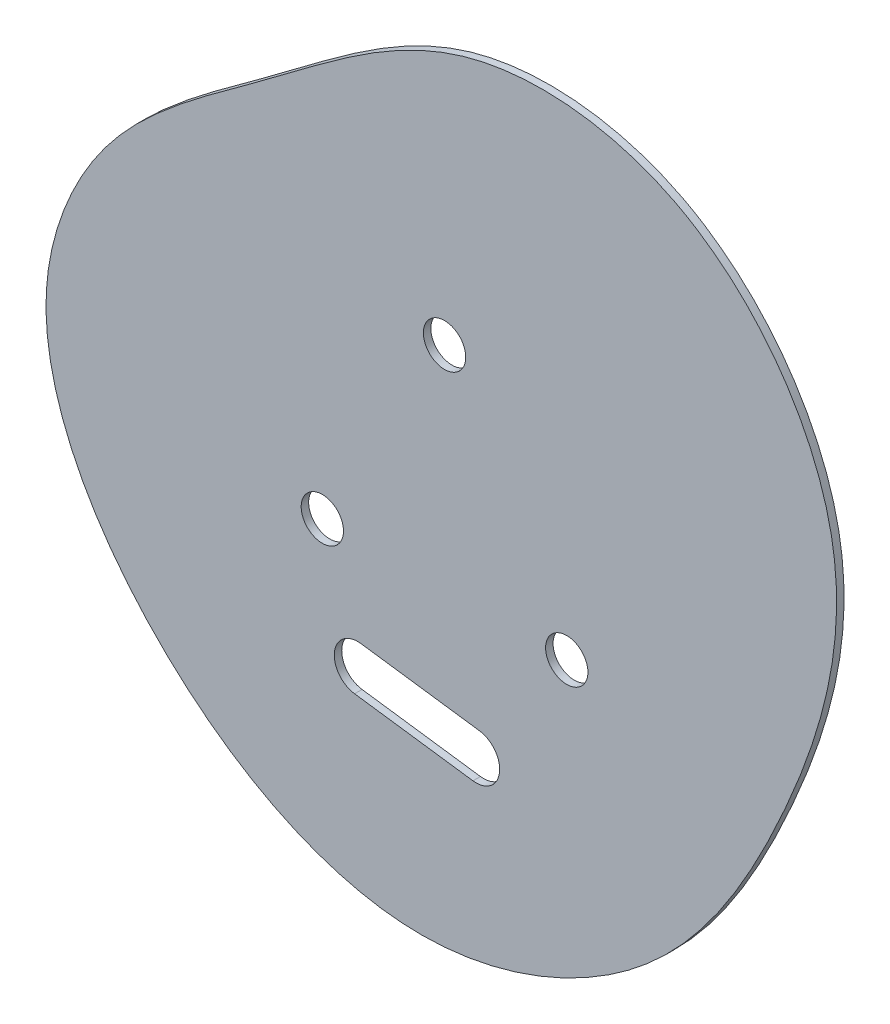
ISO-10303-21;
HEADER;
FILE_DESCRIPTION(('STEP AP214'),'2;1');
FILE_NAME('part.step','',(''),(''),'','','');
FILE_SCHEMA(('AUTOMOTIVE_DESIGN { 1 0 10303 214 1 1 1 1 }'));
ENDSEC;
DATA;
#1=APPLICATION_CONTEXT('core data for automotive mechanical design processes');
#2=APPLICATION_PROTOCOL_DEFINITION('international standard','automotive_design',2000,#1);
#3=PRODUCT_CONTEXT('',#1,'mechanical');
#4=PRODUCT('Part','Part','',(#3));
#5=PRODUCT_RELATED_PRODUCT_CATEGORY('part','',(#4));
#6=PRODUCT_DEFINITION_FORMATION('','',#4);
#7=PRODUCT_DEFINITION_CONTEXT('part definition',#1,'design');
#8=PRODUCT_DEFINITION('design','',#6,#7);
#9=PRODUCT_DEFINITION_SHAPE('','',#8);
#10=(LENGTH_UNIT() NAMED_UNIT(*) SI_UNIT(.MILLI.,.METRE.));
#11=(NAMED_UNIT(*) PLANE_ANGLE_UNIT() SI_UNIT($,.RADIAN.));
#12=(NAMED_UNIT(*) SI_UNIT($,.STERADIAN.) SOLID_ANGLE_UNIT());
#13=UNCERTAINTY_MEASURE_WITH_UNIT(LENGTH_MEASURE(1.E-05),#10,'distance_accuracy_value','');
#14=(GEOMETRIC_REPRESENTATION_CONTEXT(3) GLOBAL_UNCERTAINTY_ASSIGNED_CONTEXT((#13)) GLOBAL_UNIT_ASSIGNED_CONTEXT((#10,
#11,#12)) REPRESENTATION_CONTEXT('',''));
#15=CARTESIAN_POINT('',(0.,0.,0.));
#16=DIRECTION('',(0.,0.,1.));
#17=DIRECTION('',(1.,0.,0.));
#18=AXIS2_PLACEMENT_3D('',#15,#16,#17);
#19=CARTESIAN_POINT('',(-33.7591925316214,-51.0877572958972,-0.396875));
#20=DIRECTION('',(0.,0.,1.));
#21=DIRECTION('',(-1.,0.,0.));
#22=AXIS2_PLACEMENT_3D('',#19,#20,#21);
#23=PLANE('',#22);
#24=DIRECTION('',(0.990734013971996,-0.135816470131342,0.));
#25=VECTOR('',#24,1.);
#26=CARTESIAN_POINT('',(-22.1553572482574,-38.1563847863937,-0.396875));
#27=LINE('',#26,#25);
#28=CARTESIAN_POINT('',(-22.1553572482574,-38.1563847863937,-0.396875));
#29=VERTEX_POINT('',#28);
#30=CARTESIAN_POINT('',(-9.5730352708131,-39.8812539570617,-0.396875));
#31=VERTEX_POINT('',#30);
#32=EDGE_CURVE('E94',#29,#31,#27,.T.);
#33=ORIENTED_EDGE('',*,*,#32,.T.);
#34=CARTESIAN_POINT('',(-9.23349409548474,-37.4044189221317,-0.396875));
#35=DIRECTION('',(0.,0.,1.));
#36=DIRECTION('',(1.,0.,0.));
#37=AXIS2_PLACEMENT_3D('',#34,#35,#36);
#38=CIRCLE('',#37,2.5);
#39=CARTESIAN_POINT('',(-8.89395292015639,-34.9275838872017,-0.396875));
#40=VERTEX_POINT('',#39);
#41=EDGE_CURVE('E77',#31,#40,#38,.T.);
#42=ORIENTED_EDGE('',*,*,#41,.T.);
#43=DIRECTION('',(-0.990734013971995,0.135816470131342,0.));
#44=VECTOR('',#43,1.);
#45=CARTESIAN_POINT('',(-21.4762748976007,-33.2027147165337,-0.396875));
#46=LINE('',#45,#44);
#47=CARTESIAN_POINT('',(-21.4762748976007,-33.2027147165337,-0.396875));
#48=VERTEX_POINT('',#47);
#49=EDGE_CURVE('E88',#40,#48,#46,.T.);
#50=ORIENTED_EDGE('',*,*,#49,.T.);
#51=CARTESIAN_POINT('',(-21.8158160729291,-35.6795497514637,-0.396875));
#52=DIRECTION('',(0.,0.,1.));
#53=DIRECTION('',(1.,0.,0.));
#54=AXIS2_PLACEMENT_3D('',#51,#52,#53);
#55=CIRCLE('',#54,2.5);
#56=EDGE_CURVE('E40',#48,#29,#55,.T.);
#57=ORIENTED_EDGE('',*,*,#56,.T.);
#58=EDGE_LOOP('',(#33,#42,#50,#57));
#59=FACE_BOUND('',#58,.T.);
#60=CARTESIAN_POINT('',(-12.5939001772955,-1.27258597502269,-0.396875));
#61=DIRECTION('',(0.,0.,1.));
#62=DIRECTION('',(1.,0.,0.));
#63=AXIS2_PLACEMENT_3D('',#60,#61,#62);
#64=CIRCLE('',#63,2.25);
#65=CARTESIAN_POINT('',(-10.3439001772955,-1.27258597502269,-0.396875));
#66=VERTEX_POINT('',#65);
#67=EDGE_CURVE('E126',#66,#66,#64,.T.);
#68=ORIENTED_EDGE('',*,*,#67,.T.);
#69=EDGE_LOOP('',(#68));
#70=FACE_BOUND('',#69,.T.);
#71=CARTESIAN_POINT('',(-25.5842812340614,-23.7725859750231,-0.396875));
#72=DIRECTION('',(0.,0.,1.));
#73=DIRECTION('',(1.,0.,0.));
#74=AXIS2_PLACEMENT_3D('',#71,#72,#73);
#75=CIRCLE('',#74,2.25);
#76=CARTESIAN_POINT('',(-23.3342812340614,-23.7725859750231,-0.396875));
#77=VERTEX_POINT('',#76);
#78=EDGE_CURVE('E114',#77,#77,#75,.T.);
#79=ORIENTED_EDGE('',*,*,#78,.T.);
#80=EDGE_LOOP('',(#79));
#81=FACE_BOUND('',#80,.T.);
#82=CARTESIAN_POINT('',(11.9386620524207,24.1185465457295,-0.396875));
#83=CARTESIAN_POINT('',(5.20364440677925,27.6120992019078,-0.396875));
#84=CARTESIAN_POINT('',(-12.2470174353586,29.2167614094966,-0.396875));
#85=CARTESIAN_POINT('',(-30.8394974353756,13.6101851488787,-0.396875));
#86=CARTESIAN_POINT('',(-49.3034840199693,1.48863444913924,-0.396875));
#87=CARTESIAN_POINT('',(-58.548601808476,-21.6644469486417,-0.396875));
#88=CARTESIAN_POINT('',(-44.4112406156228,-46.5615027796323,-0.396875));
#89=CARTESIAN_POINT('',(-17.2285118260004,-61.1448782543022,-0.396875));
#90=CARTESIAN_POINT('',(10.6799256136422,-49.6929208569942,-0.396875));
#91=CARTESIAN_POINT('',(24.5536983635309,-26.479665335045,-0.396875));
#92=CARTESIAN_POINT('',(33.3871372918512,1.6837146830878,-0.396875));
#93=CARTESIAN_POINT('',(20.4165403598043,19.7209464446097,-0.396875));
#94=CARTESIAN_POINT('',(11.9386620524207,24.1185465457295,-0.396875));
#95=B_SPLINE_CURVE_WITH_KNOTS('',3,(#82,#83,#84,#85,#86,#87,#88,#89,#90,#91,#92,#93,#94),
.UNSPECIFIED.,.T.,.F.,(4,1,1,1,1,1,1,1,1,1,4),(0.,0.0865126839490203,0.186061084877596,
0.274989579634364,0.344292201608353,0.456117157494113,0.576745765831715,0.675937243701793,
0.775538108496092,0.891099913147283,1.),.UNSPECIFIED.);
#96=CARTESIAN_POINT('',(11.9386620524207,24.1185465457295,-0.396875));
#97=VERTEX_POINT('',#96);
#98=EDGE_CURVE('E11',#97,#97,#95,.T.);
#99=ORIENTED_EDGE('',*,*,#98,.F.);
#100=EDGE_LOOP('',(#99));
#101=FACE_BOUND('',#100,.T.);
#102=CARTESIAN_POINT('',(0.396480879471766,-23.7725859750223,-0.396875));
#103=DIRECTION('',(0.,0.,1.));
#104=DIRECTION('',(1.,0.,0.));
#105=AXIS2_PLACEMENT_3D('',#102,#103,#104);
#106=CIRCLE('',#105,2.25);
#107=CARTESIAN_POINT('',(2.64648087947177,-23.7725859750223,-0.396875));
#108=VERTEX_POINT('',#107);
#109=EDGE_CURVE('E120',#108,#108,#106,.T.);
#110=ORIENTED_EDGE('',*,*,#109,.T.);
#111=EDGE_LOOP('',(#110));
#112=FACE_BOUND('',#111,.T.);
#113=ADVANCED_FACE('F35',(#59,#70,#81,#101,#112),#23,.F.);
#114=CARTESIAN_POINT('',(-33.7591925316214,-51.0877572958972,0.396875));
#115=DIRECTION('',(0.,0.,1.));
#116=DIRECTION('',(-1.,0.,0.));
#117=AXIS2_PLACEMENT_3D('',#114,#115,#116);
#118=PLANE('',#117);
#119=CARTESIAN_POINT('',(-21.8158160729291,-35.6795497514637,0.396875));
#120=DIRECTION('',(0.,0.,1.));
#121=DIRECTION('',(1.,0.,0.));
#122=AXIS2_PLACEMENT_3D('',#119,#120,#121);
#123=CIRCLE('',#122,2.5);
#124=CARTESIAN_POINT('',(-21.4762748976007,-33.2027147165337,0.396875));
#125=VERTEX_POINT('',#124);
#126=CARTESIAN_POINT('',(-22.1553572482574,-38.1563847863937,0.396875));
#127=VERTEX_POINT('',#126);
#128=EDGE_CURVE('E137',#125,#127,#123,.T.);
#129=ORIENTED_EDGE('',*,*,#128,.F.);
#130=DIRECTION('',(-0.990734013971995,0.135816470131342,0.));
#131=VECTOR('',#130,1.);
#132=CARTESIAN_POINT('',(-21.4762748976007,-33.2027147165337,0.396875));
#133=LINE('',#132,#131);
#134=CARTESIAN_POINT('',(-8.89395292015639,-34.9275838872017,0.396875));
#135=VERTEX_POINT('',#134);
#136=EDGE_CURVE('E131',#135,#125,#133,.T.);
#137=ORIENTED_EDGE('',*,*,#136,.F.);
#138=CARTESIAN_POINT('',(-9.23349409548474,-37.4044189221317,0.396875));
#139=DIRECTION('',(0.,0.,1.));
#140=DIRECTION('',(1.,0.,0.));
#141=AXIS2_PLACEMENT_3D('',#138,#139,#140);
#142=CIRCLE('',#141,2.5);
#143=CARTESIAN_POINT('',(-9.57303527081309,-39.8812539570617,0.396875));
#144=VERTEX_POINT('',#143);
#145=EDGE_CURVE('E81',#144,#135,#142,.T.);
#146=ORIENTED_EDGE('',*,*,#145,.F.);
#147=DIRECTION('',(0.990734013971995,-0.135816470131342,0.));
#148=VECTOR('',#147,1.);
#149=CARTESIAN_POINT('',(-22.1553572482574,-38.1563847863937,0.396875));
#150=LINE('',#149,#148);
#151=EDGE_CURVE('E135',#127,#144,#150,.T.);
#152=ORIENTED_EDGE('',*,*,#151,.F.);
#153=EDGE_LOOP('',(#129,#137,#146,#152));
#154=FACE_BOUND('',#153,.T.);
#155=CARTESIAN_POINT('',(-12.5939001772955,-1.27258597502269,0.396875));
#156=DIRECTION('',(0.,0.,1.));
#157=DIRECTION('',(1.,0.,0.));
#158=AXIS2_PLACEMENT_3D('',#155,#156,#157);
#159=CIRCLE('',#158,2.25);
#160=CARTESIAN_POINT('',(-10.3439001772955,-1.27258597502269,0.396875));
#161=VERTEX_POINT('',#160);
#162=EDGE_CURVE('E123',#161,#161,#159,.T.);
#163=ORIENTED_EDGE('',*,*,#162,.F.);
#164=EDGE_LOOP('',(#163));
#165=FACE_BOUND('',#164,.T.);
#166=CARTESIAN_POINT('',(0.396480879471766,-23.7725859750223,0.396875));
#167=DIRECTION('',(0.,0.,1.));
#168=DIRECTION('',(1.,0.,0.));
#169=AXIS2_PLACEMENT_3D('',#166,#167,#168);
#170=CIRCLE('',#169,2.25);
#171=CARTESIAN_POINT('',(2.64648087947177,-23.7725859750223,0.396875));
#172=VERTEX_POINT('',#171);
#173=EDGE_CURVE('E117',#172,#172,#170,.T.);
#174=ORIENTED_EDGE('',*,*,#173,.F.);
#175=EDGE_LOOP('',(#174));
#176=FACE_BOUND('',#175,.T.);
#177=CARTESIAN_POINT('',(11.9386620524207,24.1185465457295,0.396875));
#178=CARTESIAN_POINT('',(5.20364440677925,27.6120992019078,0.396875));
#179=CARTESIAN_POINT('',(-12.2470174353586,29.2167614094966,0.396875));
#180=CARTESIAN_POINT('',(-30.8394974353756,13.6101851488787,0.396875));
#181=CARTESIAN_POINT('',(-49.3034840199693,1.48863444913924,0.396875));
#182=CARTESIAN_POINT('',(-58.548601808476,-21.6644469486417,0.396875));
#183=CARTESIAN_POINT('',(-44.4112406156228,-46.5615027796323,0.396875));
#184=CARTESIAN_POINT('',(-17.2285118260004,-61.1448782543022,0.396875));
#185=CARTESIAN_POINT('',(10.6799256136422,-49.6929208569942,0.396875));
#186=CARTESIAN_POINT('',(24.5536983635309,-26.479665335045,0.396875));
#187=CARTESIAN_POINT('',(33.3871372918512,1.6837146830878,0.396875));
#188=CARTESIAN_POINT('',(20.4165403598043,19.7209464446097,0.396875));
#189=CARTESIAN_POINT('',(11.9386620524207,24.1185465457295,0.396875));
#190=B_SPLINE_CURVE_WITH_KNOTS('',3,(#177,#178,#179,#180,#181,#182,#183,#184,#185,#186,#187,
#188,#189),.UNSPECIFIED.,.T.,.F.,(4,1,1,1,1,1,1,1,1,1,4),(0.,0.0865126839490203,
0.186061084877596,0.274989579634364,0.344292201608353,0.456117157494113,0.576745765831715,
0.675937243701793,0.775538108496092,0.891099913147283,1.),.UNSPECIFIED.);
#191=CARTESIAN_POINT('',(11.9386620524207,24.1185465457295,0.396875));
#192=VERTEX_POINT('',#191);
#193=EDGE_CURVE('E45',#192,#192,#190,.T.);
#194=ORIENTED_EDGE('',*,*,#193,.T.);
#195=EDGE_LOOP('',(#194));
#196=FACE_BOUND('',#195,.T.);
#197=CARTESIAN_POINT('',(-25.5842812340614,-23.7725859750231,0.396875));
#198=DIRECTION('',(0.,0.,1.));
#199=DIRECTION('',(1.,0.,0.));
#200=AXIS2_PLACEMENT_3D('',#197,#198,#199);
#201=CIRCLE('',#200,2.25);
#202=CARTESIAN_POINT('',(-23.3342812340614,-23.7725859750231,0.396875));
#203=VERTEX_POINT('',#202);
#204=EDGE_CURVE('E101',#203,#203,#201,.T.);
#205=ORIENTED_EDGE('',*,*,#204,.F.);
#206=EDGE_LOOP('',(#205));
#207=FACE_BOUND('',#206,.T.);
#208=ADVANCED_FACE('F144',(#154,#165,#176,#196,#207),#118,.T.);
#209=DIRECTION('',(0.,0.,1.));
#210=VECTOR('',#209,1.);
#211=SURFACE_OF_LINEAR_EXTRUSION('',#95,#210);
#212=ORIENTED_EDGE('',*,*,#98,.T.);
#213=EDGE_LOOP('',(#212));
#214=FACE_BOUND('',#213,.T.);
#215=ORIENTED_EDGE('',*,*,#193,.F.);
#216=EDGE_LOOP('',(#215));
#217=FACE_BOUND('',#216,.T.);
#218=ADVANCED_FACE('F37',(#214,#217),#211,.T.);
#219=CARTESIAN_POINT('',(-25.5842812340614,-23.7725859750231,-0.396875));
#220=DIRECTION('',(0.,0.,-1.));
#221=DIRECTION('',(1.,0.,0.));
#222=AXIS2_PLACEMENT_3D('',#219,#220,#221);
#223=CYLINDRICAL_SURFACE('',#222,2.25);
#224=ORIENTED_EDGE('',*,*,#204,.T.);
#225=EDGE_LOOP('',(#224));
#226=FACE_BOUND('',#225,.T.);
#227=ORIENTED_EDGE('',*,*,#78,.F.);
#228=EDGE_LOOP('',(#227));
#229=FACE_BOUND('',#228,.T.);
#230=ADVANCED_FACE('F161',(#226,#229),#223,.F.);
#231=CARTESIAN_POINT('',(0.396480879471766,-23.7725859750223,-0.396875));
#232=DIRECTION('',(0.,0.,-1.));
#233=DIRECTION('',(1.,0.,0.));
#234=AXIS2_PLACEMENT_3D('',#231,#232,#233);
#235=CYLINDRICAL_SURFACE('',#234,2.25);
#236=ORIENTED_EDGE('',*,*,#173,.T.);
#237=EDGE_LOOP('',(#236));
#238=FACE_BOUND('',#237,.T.);
#239=ORIENTED_EDGE('',*,*,#109,.F.);
#240=EDGE_LOOP('',(#239));
#241=FACE_BOUND('',#240,.T.);
#242=ADVANCED_FACE('F164',(#238,#241),#235,.F.);
#243=CARTESIAN_POINT('',(-12.5939001772955,-1.27258597502269,-0.396875));
#244=DIRECTION('',(0.,0.,-1.));
#245=DIRECTION('',(1.,0.,0.));
#246=AXIS2_PLACEMENT_3D('',#243,#244,#245);
#247=CYLINDRICAL_SURFACE('',#246,2.25);
#248=ORIENTED_EDGE('',*,*,#162,.T.);
#249=EDGE_LOOP('',(#248));
#250=FACE_BOUND('',#249,.T.);
#251=ORIENTED_EDGE('',*,*,#67,.F.);
#252=EDGE_LOOP('',(#251));
#253=FACE_BOUND('',#252,.T.);
#254=ADVANCED_FACE('F168',(#250,#253),#247,.F.);
#255=CARTESIAN_POINT('',(-21.8158160729291,-35.6795497514637,0.396875));
#256=DIRECTION('',(0.,0.,-1.));
#257=DIRECTION('',(1.,0.,0.));
#258=AXIS2_PLACEMENT_3D('',#255,#256,#257);
#259=CYLINDRICAL_SURFACE('',#258,2.5);
#260=DIRECTION('',(0.,0.,-1.));
#261=VECTOR('',#260,1.);
#262=CARTESIAN_POINT('',(-22.1553572482574,-38.1563847863937,0.396875));
#263=LINE('',#262,#261);
#264=EDGE_CURVE('E52',#127,#29,#263,.T.);
#265=ORIENTED_EDGE('',*,*,#264,.T.);
#266=ORIENTED_EDGE('',*,*,#56,.F.);
#267=DIRECTION('',(0.,0.,-1.));
#268=VECTOR('',#267,1.);
#269=CARTESIAN_POINT('',(-21.4762748976007,-33.2027147165337,0.396875));
#270=LINE('',#269,#268);
#271=EDGE_CURVE('E85',#125,#48,#270,.T.);
#272=ORIENTED_EDGE('',*,*,#271,.F.);
#273=ORIENTED_EDGE('',*,*,#128,.T.);
#274=EDGE_LOOP('',(#265,#266,#272,#273));
#275=FACE_BOUND('',#274,.T.);
#276=ADVANCED_FACE('F140',(#275),#259,.F.);
#277=CARTESIAN_POINT('',(-21.4762748976007,-33.2027147165337,0.396875));
#278=DIRECTION('',(0.135816470131342,0.990734013971996,0.));
#279=DIRECTION('',(-0.990734013971995,0.135816470131342,0.));
#280=AXIS2_PLACEMENT_3D('',#277,#278,#279);
#281=PLANE('',#280);
#282=ORIENTED_EDGE('',*,*,#271,.T.);
#283=ORIENTED_EDGE('',*,*,#49,.F.);
#284=DIRECTION('',(0.,0.,-1.));
#285=VECTOR('',#284,1.);
#286=CARTESIAN_POINT('',(-8.89395292015639,-34.9275838872017,0.396875));
#287=LINE('',#286,#285);
#288=EDGE_CURVE('E73',#135,#40,#287,.T.);
#289=ORIENTED_EDGE('',*,*,#288,.F.);
#290=ORIENTED_EDGE('',*,*,#136,.T.);
#291=EDGE_LOOP('',(#282,#283,#289,#290));
#292=FACE_BOUND('',#291,.T.);
#293=ADVANCED_FACE('F89',(#292),#281,.F.);
#294=CARTESIAN_POINT('',(-9.23349409548474,-37.4044189221317,0.396875));
#295=DIRECTION('',(0.,0.,-1.));
#296=DIRECTION('',(1.,0.,0.));
#297=AXIS2_PLACEMENT_3D('',#294,#295,#296);
#298=CYLINDRICAL_SURFACE('',#297,2.5);
#299=ORIENTED_EDGE('',*,*,#288,.T.);
#300=ORIENTED_EDGE('',*,*,#41,.F.);
#301=DIRECTION('',(0.,0.,-1.));
#302=VECTOR('',#301,1.);
#303=CARTESIAN_POINT('',(-9.5730352708131,-39.8812539570617,0.396875));
#304=LINE('',#303,#302);
#305=EDGE_CURVE('E61',#144,#31,#304,.T.);
#306=ORIENTED_EDGE('',*,*,#305,.F.);
#307=ORIENTED_EDGE('',*,*,#145,.T.);
#308=EDGE_LOOP('',(#299,#300,#306,#307));
#309=FACE_BOUND('',#308,.T.);
#310=ADVANCED_FACE('F75',(#309),#298,.F.);
#311=CARTESIAN_POINT('',(-22.1553572482574,-38.1563847863937,0.396875));
#312=DIRECTION('',(-0.135816470131342,-0.990734013971996,0.));
#313=DIRECTION('',(0.990734013971996,-0.135816470131342,0.));
#314=AXIS2_PLACEMENT_3D('',#311,#312,#313);
#315=PLANE('',#314);
#316=ORIENTED_EDGE('',*,*,#305,.T.);
#317=ORIENTED_EDGE('',*,*,#32,.F.);
#318=ORIENTED_EDGE('',*,*,#264,.F.);
#319=ORIENTED_EDGE('',*,*,#151,.T.);
#320=EDGE_LOOP('',(#316,#317,#318,#319));
#321=FACE_BOUND('',#320,.T.);
#322=ADVANCED_FACE('F147',(#321),#315,.F.);
#323=CLOSED_SHELL('',(#113,#208,#218,#230,#242,#254,#276,#293,#310,#322));
#324=MANIFOLD_SOLID_BREP('B2',#323);
#325=ADVANCED_BREP_SHAPE_REPRESENTATION('',(#18,#324),#14);
#326=SHAPE_DEFINITION_REPRESENTATION(#9,#325);
ENDSEC;
END-ISO-10303-21;
